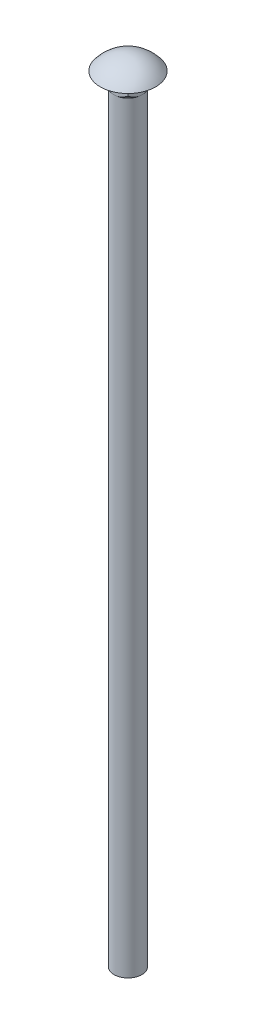
ISO-10303-21;
HEADER;
FILE_DESCRIPTION(('STEP AP214'),'2;1');
FILE_NAME('part.step','',(''),(''),'','','');
FILE_SCHEMA(('AUTOMOTIVE_DESIGN { 1 0 10303 214 1 1 1 1 }'));
ENDSEC;
DATA;
#1=APPLICATION_CONTEXT('core data for automotive mechanical design processes');
#2=APPLICATION_PROTOCOL_DEFINITION('international standard','automotive_design',2000,#1);
#3=PRODUCT_CONTEXT('',#1,'mechanical');
#4=PRODUCT('Part','Part','',(#3));
#5=PRODUCT_RELATED_PRODUCT_CATEGORY('part','',(#4));
#6=PRODUCT_DEFINITION_FORMATION('','',#4);
#7=PRODUCT_DEFINITION_CONTEXT('part definition',#1,'design');
#8=PRODUCT_DEFINITION('design','',#6,#7);
#9=PRODUCT_DEFINITION_SHAPE('','',#8);
#10=(LENGTH_UNIT() NAMED_UNIT(*) SI_UNIT(.MILLI.,.METRE.));
#11=(NAMED_UNIT(*) PLANE_ANGLE_UNIT() SI_UNIT($,.RADIAN.));
#12=(NAMED_UNIT(*) SI_UNIT($,.STERADIAN.) SOLID_ANGLE_UNIT());
#13=UNCERTAINTY_MEASURE_WITH_UNIT(LENGTH_MEASURE(1.E-05),#10,'distance_accuracy_value','');
#14=(GEOMETRIC_REPRESENTATION_CONTEXT(3) GLOBAL_UNCERTAINTY_ASSIGNED_CONTEXT((#13)) GLOBAL_UNIT_ASSIGNED_CONTEXT((#10,
#11,#12)) REPRESENTATION_CONTEXT('',''));
#15=CARTESIAN_POINT('',(0.,0.,0.));
#16=DIRECTION('',(0.,0.,1.));
#17=DIRECTION('',(1.,0.,0.));
#18=AXIS2_PLACEMENT_3D('',#15,#16,#17);
#19=CARTESIAN_POINT('',(-6.35,355.6,-6.35));
#20=DIRECTION('',(1.,0.,0.));
#21=DIRECTION('',(0.,0.,-1.));
#22=AXIS2_PLACEMENT_3D('',#19,#20,#21);
#23=PLANE('',#22);
#24=CARTESIAN_POINT('',(-6.35,364.407985068298,20.5492316571237));
#25=CARTESIAN_POINT('',(-6.35,364.050991119355,20.1755682111338));
#26=CARTESIAN_POINT('',(-6.35,363.694427489481,19.8014926199558));
#27=CARTESIAN_POINT('',(-6.35,362.982345416542,19.0523432680761));
#28=CARTESIAN_POINT('',(-6.35,362.62682698062,18.6772695005867));
#29=CARTESIAN_POINT('',(-6.35,361.916929604104,17.9258543316973));
#30=CARTESIAN_POINT('',(-6.35,361.562550994426,17.5495126175128));
#31=CARTESIAN_POINT('',(-6.35,360.855279749865,16.7954364786473));
#32=CARTESIAN_POINT('',(-6.35,360.502387111519,16.4177020572161));
#33=CARTESIAN_POINT('',(-6.35,359.795978272725,15.6579462645017));
#34=CARTESIAN_POINT('',(-6.35,359.442474542244,15.2759132909628));
#35=CARTESIAN_POINT('',(-6.35,358.737722141089,14.5097734939958));
#36=CARTESIAN_POINT('',(-6.35,358.386473464048,14.1256666764296));
#37=CARTESIAN_POINT('',(-6.35,357.686844487152,13.3549406633708));
#38=CARTESIAN_POINT('',(-6.35,357.338463805638,12.9683218148345));
#39=CARTESIAN_POINT('',(-6.35,356.645311295742,12.1918685454951));
#40=CARTESIAN_POINT('',(-6.35,356.300539426883,11.8020341608478));
#41=CARTESIAN_POINT('',(-6.35,355.56142486667,10.9561945698577));
#42=CARTESIAN_POINT('',(-6.35,355.167880195383,10.4994886062065));
#43=CARTESIAN_POINT('',(-6.35,354.584153440038,9.80876931189498));
#44=CARTESIAN_POINT('',(-6.35,354.390654279711,9.57755914588507));
#45=CARTESIAN_POINT('',(-6.35,354.00633693377,9.11292003207693));
#46=CARTESIAN_POINT('',(-6.35,353.81551873093,8.87949109855043));
#47=CARTESIAN_POINT('',(-6.35,353.437394496755,8.41031763350541));
#48=CARTESIAN_POINT('',(-6.35,353.250084096814,8.17457662886511));
#49=CARTESIAN_POINT('',(-6.35,352.879476012354,7.69996318283963));
#50=CARTESIAN_POINT('',(-6.35,352.696178228094,7.46109081952619));
#51=CARTESIAN_POINT('',(-6.35,352.334656183451,6.97964988721009));
#52=CARTESIAN_POINT('',(-6.35,352.156430261827,6.73708256936971));
#53=CARTESIAN_POINT('',(-6.35,351.806356905895,6.24740192948917));
#54=CARTESIAN_POINT('',(-6.35,351.634508873695,6.00028903683634));
#55=CARTESIAN_POINT('',(-6.35,351.315524773524,5.52507379273032));
#56=CARTESIAN_POINT('',(-6.35,351.16761987235,5.29748989163791));
#57=CARTESIAN_POINT('',(-6.35,350.880350841144,4.83693423201183));
#58=CARTESIAN_POINT('',(-6.35,350.74098764181,4.60396189015308));
#59=CARTESIAN_POINT('',(-6.35,350.47327770716,4.1315733675112));
#60=CARTESIAN_POINT('',(-6.35,350.344935059383,3.8921548387057));
#61=CARTESIAN_POINT('',(-6.35,350.102781839784,3.40617444563433));
#62=CARTESIAN_POINT('',(-6.35,349.988967997608,3.1596142043137));
#63=CARTESIAN_POINT('',(-6.35,349.72332660942,2.52167854120449));
#64=CARTESIAN_POINT('',(-6.35,349.584511136116,2.12450397536433));
#65=CARTESIAN_POINT('',(-6.35,349.425670087264,1.51657178378213));
#66=CARTESIAN_POINT('',(-6.35,349.380983070142,1.31220897893472));
#67=CARTESIAN_POINT('',(-6.35,349.310287699169,0.900224537788461));
#68=CARTESIAN_POINT('',(-6.35,349.284276911088,0.692603329790676));
#69=CARTESIAN_POINT('',(-6.35,349.252424848021,0.273613974452126));
#70=CARTESIAN_POINT('',(-6.35,349.246796781638,0.0622293328966391));
#71=CARTESIAN_POINT('',(-6.35,349.256694413638,-0.360035559707976));
#72=CARTESIAN_POINT('',(-6.35,349.272220251294,-0.570915807427129));
#73=CARTESIAN_POINT('',(-6.35,349.32341890508,-0.990616057163277));
#74=CARTESIAN_POINT('',(-6.35,349.359133497375,-1.19943087063935));
#75=CARTESIAN_POINT('',(-6.35,349.448577899689,-1.61314016288995));
#76=CARTESIAN_POINT('',(-6.35,349.502311980304,-1.81803370014699));
#77=CARTESIAN_POINT('',(-6.35,349.654634979383,-2.32040246048699));
#78=CARTESIAN_POINT('',(-6.35,349.762372568651,-2.61508903697628));
#79=CARTESIAN_POINT('',(-6.35,350.003108275344,-3.19392598496306));
#80=CARTESIAN_POINT('',(-6.35,350.136125160625,-3.47806833968619));
#81=CARTESIAN_POINT('',(-6.35,350.349879722008,-3.89778422017643));
#82=CARTESIAN_POINT('',(-6.35,350.423708511135,-4.03695163213629));
#83=CARTESIAN_POINT('',(-6.35,350.575401867176,-4.31307569079889));
#84=CARTESIAN_POINT('',(-6.35,350.653266478374,-4.45003231322141));
#85=CARTESIAN_POINT('',(-6.35,350.812414232549,-4.72185692181693));
#86=CARTESIAN_POINT('',(-6.35,350.893695880177,-4.85672578699008));
#87=CARTESIAN_POINT('',(-6.35,351.0592334799,-5.124613147354));
#88=CARTESIAN_POINT('',(-6.35,351.143489309054,-5.2576317187138));
#89=CARTESIAN_POINT('',(-6.35,351.43169852583,-5.70303435965351));
#90=CARTESIAN_POINT('',(-6.35,351.641564689349,-6.01159798493695));
#91=CARTESIAN_POINT('',(-6.35,352.071662415089,-6.62144223793977));
#92=CARTESIAN_POINT('',(-6.35,352.291896413995,-6.92272112813805));
#93=CARTESIAN_POINT('',(-6.35,352.740221451194,-7.51972871826681));
#94=CARTESIAN_POINT('',(-6.35,352.968318563863,-7.81545284169642));
#95=CARTESIAN_POINT('',(-6.35,353.430329195087,-8.40226245686343));
#96=CARTESIAN_POINT('',(-6.35,353.664242205843,-8.69334834995883));
#97=CARTESIAN_POINT('',(-6.35,354.137180116613,-9.27252441704587));
#98=CARTESIAN_POINT('',(-6.35,354.376216184142,-9.56060545129358));
#99=CARTESIAN_POINT('',(-6.35,354.857890740808,-10.1337431637271));
#100=CARTESIAN_POINT('',(-6.35,355.100529295724,-10.418799786526));
#101=CARTESIAN_POINT('',(-6.35,355.5885881296,-10.9862969488812));
#102=CARTESIAN_POINT('',(-6.35,355.834007118082,-11.2687385997406));
#103=CARTESIAN_POINT('',(-6.35,356.327205838494,-11.8315546568718));
#104=CARTESIAN_POINT('',(-6.35,356.574985589684,-12.1119290462444));
#105=CARTESIAN_POINT('',(-6.35,357.32156455074,-12.950846989386));
#106=CARTESIAN_POINT('',(-6.35,357.82327188301,-13.506802164091));
#107=CARTESIAN_POINT('',(-6.35,358.832170759314,-14.6138013254313));
#108=CARTESIAN_POINT('',(-6.35,359.339362857287,-15.1648448055578));
#109=CARTESIAN_POINT('',(-6.35,360.357149202763,-16.2625879557062));
#110=CARTESIAN_POINT('',(-6.35,360.867738816152,-16.8092919265057));
#111=CARTESIAN_POINT('',(-6.35,361.891921669361,-17.8998783776843));
#112=CARTESIAN_POINT('',(-6.35,362.405514914795,-18.4437608527862));
#113=CARTESIAN_POINT('',(-6.35,363.044051264105,-19.1170604242459));
#114=CARTESIAN_POINT('',(-6.35,363.167899902421,-19.2475170107212));
#115=CARTESIAN_POINT('',(-6.35,363.415737504732,-19.5083222933041));
#116=CARTESIAN_POINT('',(-6.35,363.539726481798,-19.6386709769942));
#117=CARTESIAN_POINT('',(-6.35,363.787701199087,-19.8991242295469));
#118=CARTESIAN_POINT('',(-6.35,363.911686819756,-20.0292289122538));
#119=CARTESIAN_POINT('',(-6.35,364.159758819817,-20.2893166525354));
#120=CARTESIAN_POINT('',(-6.35,364.283845187546,-20.419299721235));
#121=CARTESIAN_POINT('',(-6.35,364.407985068298,-20.5492316571236));
#122=B_SPLINE_CURVE_WITH_KNOTS('',3,(#24,#25,#26,#27,#28,#29,#30,#31,#32,#33,#34,#35,#36,#37,
#38,#39,#40,#41,#42,#43,#44,#45,#46,#47,#48,#49,#50,#51,#52,#53,#54,#55,#56,#57,#58,#59,#60,#61,
#62,#63,#64,#65,#66,#67,#68,#69,#70,#71,#72,#73,#74,#75,#76,#77,#78,#79,#80,#81,#82,#83,#84,#85,
#86,#87,#88,#89,#90,#91,#92,#93,#94,#95,#96,#97,#98,#99,#100,#101,#102,#103,#104,#105,#106,#107,
#108,#109,#110,#111,#112,#113,#114,#115,#116,#117,#118,#119,#120,#121),.UNSPECIFIED.,.F.,.F.,(4,
2,2,2,2,2,2,2,2,2,2,2,2,2,2,2,2,2,2,2,2,2,2,2,2,2,2,2,2,2,2,2,2,2,2,2,2,2,2,2,2,2,2,2,2,2,2,2,
4),(0.,1.55036247579737,3.10073552091107,4.65152406266354,6.20230898805667,7.76378385213553,
9.32525430490505,10.8865134907791,12.4477551456038,14.2562848915215,15.1607585516256,
16.065226397835,16.9684807714222,17.8717126675394,18.7746452313595,19.6774929353268,
20.4916101962898,21.3058160057924,22.1203225126665,22.9346453540963,24.1920538865342,
24.8189158289117,25.4456960522591,26.0790139262562,26.7123359698995,27.3469733561714,
27.9817612571752,28.9213715874029,29.8616822477871,30.3342437519393,30.806810442519,
31.2791724401169,31.7515149346104,32.8706823104493,33.9901140429873,35.1104308366206,
36.2306501540524,37.3536274217644,38.4766252195413,39.5991215743308,40.7216270950711,
42.9681581170846,45.2149181884492,47.4590694946889,49.7032249966545,50.2428699251448,
50.7825701193184,51.3217332606057,51.8608409944627),.UNSPECIFIED.);
#123=CARTESIAN_POINT('',(-6.35,351.880256121069,6.35000000000008));
#124=VERTEX_POINT('',#123);
#125=CARTESIAN_POINT('',(-6.35,349.25,0.));
#126=VERTEX_POINT('',#125);
#127=EDGE_CURVE('E127',#124,#126,#122,.T.);
#128=ORIENTED_EDGE('',*,*,#127,.F.);
#129=DIRECTION('',(0.,-1.,0.));
#130=VECTOR('',#129,1.);
#131=CARTESIAN_POINT('',(-6.35,355.6,6.35));
#132=LINE('',#131,#130);
#133=CARTESIAN_POINT('',(-6.35,355.6,6.35));
#134=VERTEX_POINT('',#133);
#135=EDGE_CURVE('E132',#134,#124,#132,.T.);
#136=ORIENTED_EDGE('',*,*,#135,.F.);
#137=DIRECTION('',(0.,0.,1.));
#138=VECTOR('',#137,1.);
#139=CARTESIAN_POINT('',(-6.35,355.6,-6.35));
#140=LINE('',#139,#138);
#141=CARTESIAN_POINT('',(-6.35,355.6,-6.35));
#142=VERTEX_POINT('',#141);
#143=EDGE_CURVE('E149',#142,#134,#140,.T.);
#144=ORIENTED_EDGE('',*,*,#143,.F.);
#145=DIRECTION('',(0.,-1.,0.));
#146=VECTOR('',#145,1.);
#147=CARTESIAN_POINT('',(-6.35,355.6,-6.35));
#148=LINE('',#147,#146);
#149=CARTESIAN_POINT('',(-6.35000000000008,351.880256121069,-6.35));
#150=VERTEX_POINT('',#149);
#151=EDGE_CURVE('E138',#142,#150,#148,.T.);
#152=ORIENTED_EDGE('',*,*,#151,.T.);
#153=EDGE_CURVE('E68',#126,#150,#122,.T.);
#154=ORIENTED_EDGE('',*,*,#153,.F.);
#155=EDGE_LOOP('',(#128,#136,#144,#152,#154));
#156=FACE_BOUND('',#155,.T.);
#157=ADVANCED_FACE('F44',(#156),#23,.F.);
#158=CARTESIAN_POINT('',(-6.35,355.6,6.35));
#159=DIRECTION('',(0.,0.,-1.));
#160=DIRECTION('',(-1.,0.,0.));
#161=AXIS2_PLACEMENT_3D('',#158,#159,#160);
#162=PLANE('',#161);
#163=CARTESIAN_POINT('',(20.5492316571237,364.407985068298,6.35));
#164=CARTESIAN_POINT('',(20.1755682111338,364.050991119355,6.35));
#165=CARTESIAN_POINT('',(19.8014926199558,363.694427489481,6.35));
#166=CARTESIAN_POINT('',(19.0523432680761,362.982345416542,6.35));
#167=CARTESIAN_POINT('',(18.6772695005867,362.62682698062,6.35));
#168=CARTESIAN_POINT('',(17.9258543316972,361.916929604104,6.35));
#169=CARTESIAN_POINT('',(17.5495126175127,361.562550994426,6.35));
#170=CARTESIAN_POINT('',(16.7954364786473,360.855279749865,6.35));
#171=CARTESIAN_POINT('',(16.4177020572161,360.502387111519,6.35));
#172=CARTESIAN_POINT('',(15.6579462645017,359.795978272725,6.35));
#173=CARTESIAN_POINT('',(15.2759132909628,359.442474542244,6.35));
#174=CARTESIAN_POINT('',(14.5097734939958,358.737722141089,6.35));
#175=CARTESIAN_POINT('',(14.1256666764296,358.386473464048,6.35));
#176=CARTESIAN_POINT('',(13.3549406633708,357.686844487152,6.35));
#177=CARTESIAN_POINT('',(12.9683218148345,357.338463805638,6.35));
#178=CARTESIAN_POINT('',(12.1918685454951,356.645311295742,6.35));
#179=CARTESIAN_POINT('',(11.8020341608478,356.300539426883,6.35));
#180=CARTESIAN_POINT('',(10.9561945698577,355.56142486667,6.35));
#181=CARTESIAN_POINT('',(10.4994886062065,355.167880195383,6.35));
#182=CARTESIAN_POINT('',(9.80876931189498,354.584153440038,6.35));
#183=CARTESIAN_POINT('',(9.57755914588507,354.390654279711,6.35));
#184=CARTESIAN_POINT('',(9.11292003207693,354.00633693377,6.35));
#185=CARTESIAN_POINT('',(8.87949109855043,353.81551873093,6.35));
#186=CARTESIAN_POINT('',(8.41031763350541,353.437394496755,6.35));
#187=CARTESIAN_POINT('',(8.17457662886511,353.250084096814,6.35));
#188=CARTESIAN_POINT('',(7.69996318283963,352.879476012354,6.35));
#189=CARTESIAN_POINT('',(7.46109081952618,352.696178228094,6.35));
#190=CARTESIAN_POINT('',(6.97964988721008,352.334656183451,6.35));
#191=CARTESIAN_POINT('',(6.7370825693697,352.156430261827,6.35));
#192=CARTESIAN_POINT('',(6.24740192948915,351.806356905895,6.35));
#193=CARTESIAN_POINT('',(6.00028903683633,351.634508873695,6.35));
#194=CARTESIAN_POINT('',(5.52507379273031,351.315524773524,6.35));
#195=CARTESIAN_POINT('',(5.29748989163791,351.16761987235,6.35));
#196=CARTESIAN_POINT('',(4.83693423201184,350.880350841144,6.35));
#197=CARTESIAN_POINT('',(4.60396189015308,350.74098764181,6.35));
#198=CARTESIAN_POINT('',(4.13157336751121,350.47327770716,6.35));
#199=CARTESIAN_POINT('',(3.89215483870572,350.344935059383,6.35));
#200=CARTESIAN_POINT('',(3.40617444563434,350.102781839784,6.35));
#201=CARTESIAN_POINT('',(3.15961420431371,349.988967997608,6.35));
#202=CARTESIAN_POINT('',(2.5216785412045,349.72332660942,6.35));
#203=CARTESIAN_POINT('',(2.12450397536434,349.584511136116,6.35));
#204=CARTESIAN_POINT('',(1.51657178378213,349.425670087264,6.35));
#205=CARTESIAN_POINT('',(1.31220897893472,349.380983070142,6.35));
#206=CARTESIAN_POINT('',(0.900224537788463,349.310287699169,6.35));
#207=CARTESIAN_POINT('',(0.692603329790679,349.284276911088,6.35));
#208=CARTESIAN_POINT('',(0.273613974452125,349.252424848021,6.35));
#209=CARTESIAN_POINT('',(0.0622293328966355,349.246796781638,6.35));
#210=CARTESIAN_POINT('',(-0.360035559707983,349.256694413638,6.35));
#211=CARTESIAN_POINT('',(-0.570915807427137,349.272220251294,6.35));
#212=CARTESIAN_POINT('',(-0.990616057163283,349.32341890508,6.35));
#213=CARTESIAN_POINT('',(-1.19943087063935,349.359133497375,6.35));
#214=CARTESIAN_POINT('',(-1.61314016288995,349.448577899689,6.35));
#215=CARTESIAN_POINT('',(-1.818033700147,349.502311980304,6.35));
#216=CARTESIAN_POINT('',(-2.32040246048701,349.654634979383,6.35));
#217=CARTESIAN_POINT('',(-2.61508903697632,349.762372568651,6.35));
#218=CARTESIAN_POINT('',(-3.1939259849631,350.003108275344,6.35));
#219=CARTESIAN_POINT('',(-3.47806833968621,350.136125160625,6.35));
#220=CARTESIAN_POINT('',(-3.89778422017643,350.349879722008,6.35));
#221=CARTESIAN_POINT('',(-4.0369516321363,350.423708511135,6.35));
#222=CARTESIAN_POINT('',(-4.31307569079888,350.575401867176,6.35));
#223=CARTESIAN_POINT('',(-4.45003231322138,350.653266478374,6.35));
#224=CARTESIAN_POINT('',(-4.72185692181688,350.812414232549,6.35));
#225=CARTESIAN_POINT('',(-4.85672578699002,350.893695880177,6.35));
#226=CARTESIAN_POINT('',(-5.12461314735396,351.0592334799,6.35));
#227=CARTESIAN_POINT('',(-5.25763171871378,351.143489309054,6.35));
#228=CARTESIAN_POINT('',(-5.70303435965349,351.43169852583,6.35));
#229=CARTESIAN_POINT('',(-6.01159798493694,351.641564689349,6.35));
#230=CARTESIAN_POINT('',(-6.62144223793976,352.071662415089,6.35));
#231=CARTESIAN_POINT('',(-6.92272112813805,352.291896413995,6.35));
#232=CARTESIAN_POINT('',(-7.51972871826679,352.740221451194,6.35));
#233=CARTESIAN_POINT('',(-7.81545284169639,352.968318563863,6.35));
#234=CARTESIAN_POINT('',(-8.40226245686341,353.430329195087,6.35));
#235=CARTESIAN_POINT('',(-8.69334834995882,353.664242205843,6.35));
#236=CARTESIAN_POINT('',(-9.27252441704587,354.137180116613,6.35));
#237=CARTESIAN_POINT('',(-9.56060545129358,354.376216184142,6.35));
#238=CARTESIAN_POINT('',(-10.1337431637271,354.857890740808,6.35));
#239=CARTESIAN_POINT('',(-10.418799786526,355.100529295724,6.35));
#240=CARTESIAN_POINT('',(-10.9862969488812,355.5885881296,6.35));
#241=CARTESIAN_POINT('',(-11.2687385997406,355.834007118082,6.35));
#242=CARTESIAN_POINT('',(-11.8315546568718,356.327205838494,6.35));
#243=CARTESIAN_POINT('',(-12.1119290462444,356.574985589684,6.35));
#244=CARTESIAN_POINT('',(-12.950846989386,357.32156455074,6.35));
#245=CARTESIAN_POINT('',(-13.5068021640909,357.82327188301,6.35));
#246=CARTESIAN_POINT('',(-14.6138013254312,358.832170759314,6.35));
#247=CARTESIAN_POINT('',(-15.1648448055578,359.339362857287,6.35));
#248=CARTESIAN_POINT('',(-16.2625879557062,360.357149202763,6.35));
#249=CARTESIAN_POINT('',(-16.8092919265058,360.867738816152,6.35));
#250=CARTESIAN_POINT('',(-17.8998783776843,361.891921669361,6.35));
#251=CARTESIAN_POINT('',(-18.4437608527862,362.405514914795,6.35));
#252=CARTESIAN_POINT('',(-19.1170604242459,363.044051264105,6.35));
#253=CARTESIAN_POINT('',(-19.2475170107212,363.167899902421,6.35));
#254=CARTESIAN_POINT('',(-19.5083222933041,363.415737504732,6.35));
#255=CARTESIAN_POINT('',(-19.6386709769942,363.539726481798,6.35));
#256=CARTESIAN_POINT('',(-19.8991242295469,363.787701199088,6.35));
#257=CARTESIAN_POINT('',(-20.0292289122538,363.911686819756,6.35));
#258=CARTESIAN_POINT('',(-20.2893166525355,364.159758819817,6.35));
#259=CARTESIAN_POINT('',(-20.4192997212351,364.283845187546,6.35));
#260=CARTESIAN_POINT('',(-20.5492316571236,364.407985068298,6.35));
#261=B_SPLINE_CURVE_WITH_KNOTS('',3,(#163,#164,#165,#166,#167,#168,#169,#170,#171,#172,#173,
#174,#175,#176,#177,#178,#179,#180,#181,#182,#183,#184,#185,#186,#187,#188,#189,#190,#191,#192,
#193,#194,#195,#196,#197,#198,#199,#200,#201,#202,#203,#204,#205,#206,#207,#208,#209,#210,#211,
#212,#213,#214,#215,#216,#217,#218,#219,#220,#221,#222,#223,#224,#225,#226,#227,#228,#229,#230,
#231,#232,#233,#234,#235,#236,#237,#238,#239,#240,#241,#242,#243,#244,#245,#246,#247,#248,#249,
#250,#251,#252,#253,#254,#255,#256,#257,#258,#259,#260),.UNSPECIFIED.,.F.,.F.,(4,2,2,2,2,2,2,2,
2,2,2,2,2,2,2,2,2,2,2,2,2,2,2,2,2,2,2,2,2,2,2,2,2,2,2,2,2,2,2,2,2,2,2,2,2,2,2,2,4),(0.,
1.55036247579737,3.10073552091107,4.65152406266362,6.20230898805667,7.76378385213553,
9.32525430490504,10.8865134907791,12.4477551456039,14.2562848915215,15.1607585516256,
16.065226397835,16.9684807714222,17.8717126675394,18.7746452313595,19.6774929353268,
20.4916101962898,21.3058160057924,22.1203225126664,22.9346453540963,24.1920538865342,
24.8189158289117,25.4456960522591,26.0790139262562,26.7123359698995,27.3469733561714,
27.9817612571752,28.921371587403,29.8616822477871,30.3342437519393,30.8068104425189,
31.2791724401168,31.7515149346104,32.8706823104493,33.9901140429873,35.1104308366206,
36.2306501540524,37.3536274217644,38.4766252195413,39.5991215743308,40.7216270950711,
42.9681581170846,45.2149181884492,47.4590694946889,49.7032249966545,50.2428699251448,
50.7825701193185,51.3217332606058,51.8608409944627),.UNSPECIFIED.);
#262=CARTESIAN_POINT('',(6.35,351.880256121069,6.35));
#263=VERTEX_POINT('',#262);
#264=CARTESIAN_POINT('',(0.,349.25,6.35));
#265=VERTEX_POINT('',#264);
#266=EDGE_CURVE('E108',#263,#265,#261,.T.);
#267=ORIENTED_EDGE('',*,*,#266,.F.);
#268=DIRECTION('',(0.,-1.,0.));
#269=VECTOR('',#268,1.);
#270=CARTESIAN_POINT('',(6.35,355.6,6.35));
#271=LINE('',#270,#269);
#272=CARTESIAN_POINT('',(6.35,355.6,6.35));
#273=VERTEX_POINT('',#272);
#274=EDGE_CURVE('E125',#273,#263,#271,.T.);
#275=ORIENTED_EDGE('',*,*,#274,.F.);
#276=DIRECTION('',(1.,0.,0.));
#277=VECTOR('',#276,1.);
#278=CARTESIAN_POINT('',(-6.35,355.6,6.35));
#279=LINE('',#278,#277);
#280=EDGE_CURVE('E146',#134,#273,#279,.T.);
#281=ORIENTED_EDGE('',*,*,#280,.F.);
#282=ORIENTED_EDGE('',*,*,#135,.T.);
#283=EDGE_CURVE('E126',#265,#124,#261,.T.);
#284=ORIENTED_EDGE('',*,*,#283,.F.);
#285=EDGE_LOOP('',(#267,#275,#281,#282,#284));
#286=FACE_BOUND('',#285,.T.);
#287=ADVANCED_FACE('F167',(#286),#162,.F.);
#288=CARTESIAN_POINT('',(6.35,355.6,-6.35));
#289=DIRECTION('',(-1.,0.,0.));
#290=DIRECTION('',(0.,0.,1.));
#291=AXIS2_PLACEMENT_3D('',#288,#289,#290);
#292=PLANE('',#291);
#293=CARTESIAN_POINT('',(6.35,364.407985068298,-20.5492316571237));
#294=CARTESIAN_POINT('',(6.35,364.050991119355,-20.1755682111338));
#295=CARTESIAN_POINT('',(6.35,363.694427489481,-19.8014926199558));
#296=CARTESIAN_POINT('',(6.35,362.982345416542,-19.0523432680761));
#297=CARTESIAN_POINT('',(6.35,362.62682698062,-18.6772695005867));
#298=CARTESIAN_POINT('',(6.35,361.916929604104,-17.9258543316972));
#299=CARTESIAN_POINT('',(6.35,361.562550994426,-17.5495126175127));
#300=CARTESIAN_POINT('',(6.35,360.855279749865,-16.7954364786473));
#301=CARTESIAN_POINT('',(6.35,360.502387111519,-16.4177020572161));
#302=CARTESIAN_POINT('',(6.35,359.795978272725,-15.6579462645017));
#303=CARTESIAN_POINT('',(6.35,359.442474542244,-15.2759132909628));
#304=CARTESIAN_POINT('',(6.35,358.737722141089,-14.5097734939958));
#305=CARTESIAN_POINT('',(6.35,358.386473464048,-14.1256666764296));
#306=CARTESIAN_POINT('',(6.35,357.686844487152,-13.3549406633708));
#307=CARTESIAN_POINT('',(6.35,357.338463805638,-12.9683218148344));
#308=CARTESIAN_POINT('',(6.35,356.645311295742,-12.1918685454951));
#309=CARTESIAN_POINT('',(6.35,356.300539426883,-11.8020341608478));
#310=CARTESIAN_POINT('',(6.35,355.56142486667,-10.9561945698577));
#311=CARTESIAN_POINT('',(6.35,355.167880195383,-10.4994886062065));
#312=CARTESIAN_POINT('',(6.35,354.584153440038,-9.80876931189498));
#313=CARTESIAN_POINT('',(6.35,354.390654279711,-9.57755914588507));
#314=CARTESIAN_POINT('',(6.35,354.00633693377,-9.11292003207693));
#315=CARTESIAN_POINT('',(6.35,353.81551873093,-8.87949109855043));
#316=CARTESIAN_POINT('',(6.35,353.437394496755,-8.41031763350541));
#317=CARTESIAN_POINT('',(6.35,353.250084096814,-8.17457662886511));
#318=CARTESIAN_POINT('',(6.35,352.879476012354,-7.69996318283963));
#319=CARTESIAN_POINT('',(6.35,352.696178228094,-7.46109081952618));
#320=CARTESIAN_POINT('',(6.35,352.334656183451,-6.97964988721008));
#321=CARTESIAN_POINT('',(6.35,352.156430261827,-6.7370825693697));
#322=CARTESIAN_POINT('',(6.35,351.806356905895,-6.24740192948916));
#323=CARTESIAN_POINT('',(6.35,351.634508873695,-6.00028903683633));
#324=CARTESIAN_POINT('',(6.35,351.315524773524,-5.52507379273031));
#325=CARTESIAN_POINT('',(6.35,351.16761987235,-5.29748989163791));
#326=CARTESIAN_POINT('',(6.35,350.880350841144,-4.83693423201184));
#327=CARTESIAN_POINT('',(6.35,350.74098764181,-4.60396189015308));
#328=CARTESIAN_POINT('',(6.35,350.47327770716,-4.13157336751121));
#329=CARTESIAN_POINT('',(6.35,350.344935059383,-3.89215483870572));
#330=CARTESIAN_POINT('',(6.35,350.102781839784,-3.40617444563434));
#331=CARTESIAN_POINT('',(6.35,349.988967997608,-3.15961420431371));
#332=CARTESIAN_POINT('',(6.35,349.72332660942,-2.5216785412045));
#333=CARTESIAN_POINT('',(6.35,349.584511136116,-2.12450397536435));
#334=CARTESIAN_POINT('',(6.35,349.425670087264,-1.51657178378213));
#335=CARTESIAN_POINT('',(6.35,349.380983070142,-1.31220897893472));
#336=CARTESIAN_POINT('',(6.35,349.310287699169,-0.900224537788464));
#337=CARTESIAN_POINT('',(6.35,349.284276911088,-0.692603329790679));
#338=CARTESIAN_POINT('',(6.35,349.252424848021,-0.273613974452127));
#339=CARTESIAN_POINT('',(6.35,349.246796781638,-0.0622293328966371));
#340=CARTESIAN_POINT('',(6.35,349.256694413638,0.360035559707982));
#341=CARTESIAN_POINT('',(6.35,349.272220251294,0.570915807427137));
#342=CARTESIAN_POINT('',(6.35,349.32341890508,0.990616057163281));
#343=CARTESIAN_POINT('',(6.35,349.359133497375,1.19943087063934));
#344=CARTESIAN_POINT('',(6.35,349.448577899689,1.61314016288995));
#345=CARTESIAN_POINT('',(6.35,349.502311980304,1.81803370014699));
#346=CARTESIAN_POINT('',(6.35,349.654634979383,2.32040246048699));
#347=CARTESIAN_POINT('',(6.35,349.762372568651,2.61508903697628));
#348=CARTESIAN_POINT('',(6.35,350.003108275344,3.19392598496306));
#349=CARTESIAN_POINT('',(6.35,350.136125160625,3.47806833968619));
#350=CARTESIAN_POINT('',(6.35,350.349879722008,3.89778422017644));
#351=CARTESIAN_POINT('',(6.35,350.423708511135,4.03695163213631));
#352=CARTESIAN_POINT('',(6.35,350.575401867176,4.31307569079891));
#353=CARTESIAN_POINT('',(6.35,350.653266478374,4.45003231322142));
#354=CARTESIAN_POINT('',(6.35,350.812414232549,4.72185692181693));
#355=CARTESIAN_POINT('',(6.35,350.893695880177,4.85672578699008));
#356=CARTESIAN_POINT('',(6.35,351.0592334799,5.124613147354));
#357=CARTESIAN_POINT('',(6.35,351.143489309054,5.25763171871381));
#358=CARTESIAN_POINT('',(6.35,351.43169852583,5.70303435965351));
#359=CARTESIAN_POINT('',(6.35,351.641564689349,6.01159798493695));
#360=CARTESIAN_POINT('',(6.35,352.071662415089,6.62144223793977));
#361=CARTESIAN_POINT('',(6.35,352.291896413995,6.92272112813805));
#362=CARTESIAN_POINT('',(6.35,352.740221451194,7.51972871826681));
#363=CARTESIAN_POINT('',(6.35,352.968318563863,7.81545284169642));
#364=CARTESIAN_POINT('',(6.35,353.430329195087,8.40226245686343));
#365=CARTESIAN_POINT('',(6.35,353.664242205843,8.69334834995883));
#366=CARTESIAN_POINT('',(6.35,354.137180116613,9.27252441704587));
#367=CARTESIAN_POINT('',(6.35,354.376216184142,9.56060545129358));
#368=CARTESIAN_POINT('',(6.35,354.857890740808,10.1337431637271));
#369=CARTESIAN_POINT('',(6.35,355.100529295724,10.418799786526));
#370=CARTESIAN_POINT('',(6.35,355.5885881296,10.9862969488812));
#371=CARTESIAN_POINT('',(6.35,355.834007118082,11.2687385997406));
#372=CARTESIAN_POINT('',(6.35,356.327205838494,11.8315546568718));
#373=CARTESIAN_POINT('',(6.35,356.574985589684,12.1119290462444));
#374=CARTESIAN_POINT('',(6.35,357.32156455074,12.950846989386));
#375=CARTESIAN_POINT('',(6.35,357.82327188301,13.506802164091));
#376=CARTESIAN_POINT('',(6.35,358.832170759314,14.6138013254313));
#377=CARTESIAN_POINT('',(6.35,359.339362857287,15.1648448055578));
#378=CARTESIAN_POINT('',(6.35,360.357149202763,16.2625879557062));
#379=CARTESIAN_POINT('',(6.35,360.867738816152,16.8092919265057));
#380=CARTESIAN_POINT('',(6.35,361.891921669361,17.8998783776843));
#381=CARTESIAN_POINT('',(6.35,362.405514914795,18.4437608527862));
#382=CARTESIAN_POINT('',(6.35,363.044051264105,19.1170604242459));
#383=CARTESIAN_POINT('',(6.35,363.167899902421,19.2475170107212));
#384=CARTESIAN_POINT('',(6.35,363.415737504732,19.5083222933041));
#385=CARTESIAN_POINT('',(6.35,363.539726481798,19.6386709769942));
#386=CARTESIAN_POINT('',(6.35,363.787701199088,19.8991242295469));
#387=CARTESIAN_POINT('',(6.35,363.911686819756,20.0292289122538));
#388=CARTESIAN_POINT('',(6.35,364.159758819817,20.2893166525355));
#389=CARTESIAN_POINT('',(6.35,364.283845187546,20.4192997212351));
#390=CARTESIAN_POINT('',(6.35,364.407985068298,20.5492316571236));
#391=B_SPLINE_CURVE_WITH_KNOTS('',3,(#293,#294,#295,#296,#297,#298,#299,#300,#301,#302,#303,
#304,#305,#306,#307,#308,#309,#310,#311,#312,#313,#314,#315,#316,#317,#318,#319,#320,#321,#322,
#323,#324,#325,#326,#327,#328,#329,#330,#331,#332,#333,#334,#335,#336,#337,#338,#339,#340,#341,
#342,#343,#344,#345,#346,#347,#348,#349,#350,#351,#352,#353,#354,#355,#356,#357,#358,#359,#360,
#361,#362,#363,#364,#365,#366,#367,#368,#369,#370,#371,#372,#373,#374,#375,#376,#377,#378,#379,
#380,#381,#382,#383,#384,#385,#386,#387,#388,#389,#390),.UNSPECIFIED.,.F.,.F.,(4,2,2,2,2,2,2,2,
2,2,2,2,2,2,2,2,2,2,2,2,2,2,2,2,2,2,2,2,2,2,2,2,2,2,2,2,2,2,2,2,2,2,2,2,2,2,2,2,4),(0.,
1.55036247579737,3.10073552091107,4.65152406266362,6.20230898805667,7.76378385213553,
9.32525430490504,10.8865134907792,12.4477551456038,14.2562848915215,15.1607585516256,
16.065226397835,16.9684807714222,17.8717126675394,18.7746452313595,19.6774929353268,
20.4916101962898,21.3058160057924,22.1203225126664,22.9346453540963,24.1920538865342,
24.8189158289117,25.4456960522591,26.0790139262562,26.7123359698995,27.3469733561714,
27.9817612571752,28.9213715874029,29.8616822477871,30.3342437519393,30.806810442519,
31.2791724401169,31.7515149346104,32.8706823104493,33.9901140429873,35.1104308366206,
36.2306501540524,37.3536274217644,38.4766252195413,39.5991215743308,40.7216270950711,
42.9681581170846,45.2149181884492,47.4590694946889,49.7032249966545,50.2428699251448,
50.7825701193185,51.3217332606058,51.8608409944627),.UNSPECIFIED.);
#392=CARTESIAN_POINT('',(6.35,351.880256121069,-6.35));
#393=VERTEX_POINT('',#392);
#394=CARTESIAN_POINT('',(6.35,349.25,0.));
#395=VERTEX_POINT('',#394);
#396=EDGE_CURVE('E115',#393,#395,#391,.T.);
#397=ORIENTED_EDGE('',*,*,#396,.F.);
#398=DIRECTION('',(0.,-1.,0.));
#399=VECTOR('',#398,1.);
#400=CARTESIAN_POINT('',(6.35,355.6,-6.35));
#401=LINE('',#400,#399);
#402=CARTESIAN_POINT('',(6.35,355.6,-6.35));
#403=VERTEX_POINT('',#402);
#404=EDGE_CURVE('E136',#403,#393,#401,.T.);
#405=ORIENTED_EDGE('',*,*,#404,.F.);
#406=DIRECTION('',(0.,0.,-1.));
#407=VECTOR('',#406,1.);
#408=CARTESIAN_POINT('',(6.35,355.6,-6.35));
#409=LINE('',#408,#407);
#410=EDGE_CURVE('E143',#273,#403,#409,.T.);
#411=ORIENTED_EDGE('',*,*,#410,.F.);
#412=ORIENTED_EDGE('',*,*,#274,.T.);
#413=EDGE_CURVE('E106',#395,#263,#391,.T.);
#414=ORIENTED_EDGE('',*,*,#413,.F.);
#415=EDGE_LOOP('',(#397,#405,#411,#412,#414));
#416=FACE_BOUND('',#415,.T.);
#417=ADVANCED_FACE('F123',(#416),#292,.F.);
#418=CARTESIAN_POINT('',(-6.35,355.6,-6.35));
#419=DIRECTION('',(0.,0.,1.));
#420=DIRECTION('',(1.,0.,0.));
#421=AXIS2_PLACEMENT_3D('',#418,#419,#420);
#422=PLANE('',#421);
#423=CARTESIAN_POINT('',(-20.5492316571237,364.407985068298,-6.35));
#424=CARTESIAN_POINT('',(-20.1755682111338,364.050991119355,-6.35));
#425=CARTESIAN_POINT('',(-19.8014926199558,363.694427489481,-6.35));
#426=CARTESIAN_POINT('',(-19.0523432680761,362.982345416542,-6.35));
#427=CARTESIAN_POINT('',(-18.6772695005867,362.62682698062,-6.35));
#428=CARTESIAN_POINT('',(-17.9258543316972,361.916929604104,-6.35));
#429=CARTESIAN_POINT('',(-17.5495126175127,361.562550994426,-6.35));
#430=CARTESIAN_POINT('',(-16.7954364786473,360.855279749865,-6.35));
#431=CARTESIAN_POINT('',(-16.4177020572161,360.502387111519,-6.35));
#432=CARTESIAN_POINT('',(-15.6579462645017,359.795978272725,-6.35));
#433=CARTESIAN_POINT('',(-15.2759132909628,359.442474542244,-6.35));
#434=CARTESIAN_POINT('',(-14.5097734939958,358.737722141089,-6.35));
#435=CARTESIAN_POINT('',(-14.1256666764296,358.386473464048,-6.35));
#436=CARTESIAN_POINT('',(-13.3549406633708,357.686844487152,-6.35));
#437=CARTESIAN_POINT('',(-12.9683218148345,357.338463805638,-6.35));
#438=CARTESIAN_POINT('',(-12.1918685454951,356.645311295742,-6.35));
#439=CARTESIAN_POINT('',(-11.8020341608478,356.300539426883,-6.35));
#440=CARTESIAN_POINT('',(-10.9561945698577,355.56142486667,-6.35));
#441=CARTESIAN_POINT('',(-10.4994886062065,355.167880195383,-6.35));
#442=CARTESIAN_POINT('',(-9.80876931189498,354.584153440038,-6.35));
#443=CARTESIAN_POINT('',(-9.57755914588507,354.390654279711,-6.35));
#444=CARTESIAN_POINT('',(-9.11292003207693,354.00633693377,-6.35));
#445=CARTESIAN_POINT('',(-8.87949109855043,353.81551873093,-6.35));
#446=CARTESIAN_POINT('',(-8.41031763350541,353.437394496755,-6.35));
#447=CARTESIAN_POINT('',(-8.17457662886511,353.250084096814,-6.35));
#448=CARTESIAN_POINT('',(-7.69996318283963,352.879476012354,-6.35));
#449=CARTESIAN_POINT('',(-7.46109081952618,352.696178228094,-6.35));
#450=CARTESIAN_POINT('',(-6.97964988721008,352.334656183451,-6.35));
#451=CARTESIAN_POINT('',(-6.7370825693697,352.156430261827,-6.35));
#452=CARTESIAN_POINT('',(-6.24740192948915,351.806356905895,-6.35));
#453=CARTESIAN_POINT('',(-6.00028903683633,351.634508873695,-6.35));
#454=CARTESIAN_POINT('',(-5.52507379273031,351.315524773524,-6.35));
#455=CARTESIAN_POINT('',(-5.29748989163791,351.16761987235,-6.35));
#456=CARTESIAN_POINT('',(-4.83693423201184,350.880350841144,-6.35));
#457=CARTESIAN_POINT('',(-4.60396189015308,350.74098764181,-6.35));
#458=CARTESIAN_POINT('',(-4.13157336751121,350.47327770716,-6.35));
#459=CARTESIAN_POINT('',(-3.89215483870572,350.344935059383,-6.35));
#460=CARTESIAN_POINT('',(-3.40617444563434,350.102781839784,-6.35));
#461=CARTESIAN_POINT('',(-3.15961420431371,349.988967997608,-6.35));
#462=CARTESIAN_POINT('',(-2.5216785412045,349.72332660942,-6.35));
#463=CARTESIAN_POINT('',(-2.12450397536434,349.584511136116,-6.35));
#464=CARTESIAN_POINT('',(-1.51657178378213,349.425670087264,-6.35));
#465=CARTESIAN_POINT('',(-1.31220897893472,349.380983070142,-6.35));
#466=CARTESIAN_POINT('',(-0.900224537788463,349.310287699169,-6.35));
#467=CARTESIAN_POINT('',(-0.692603329790679,349.284276911088,-6.35));
#468=CARTESIAN_POINT('',(-0.273613974452125,349.252424848021,-6.35));
#469=CARTESIAN_POINT('',(-0.0622293328966355,349.246796781638,-6.35));
#470=CARTESIAN_POINT('',(0.360035559707983,349.256694413638,-6.35));
#471=CARTESIAN_POINT('',(0.570915807427137,349.272220251294,-6.35));
#472=CARTESIAN_POINT('',(0.990616057163283,349.32341890508,-6.35));
#473=CARTESIAN_POINT('',(1.19943087063935,349.359133497375,-6.35));
#474=CARTESIAN_POINT('',(1.61314016288995,349.448577899689,-6.35));
#475=CARTESIAN_POINT('',(1.818033700147,349.502311980304,-6.35));
#476=CARTESIAN_POINT('',(2.32040246048701,349.654634979383,-6.35));
#477=CARTESIAN_POINT('',(2.61508903697632,349.762372568651,-6.35));
#478=CARTESIAN_POINT('',(3.1939259849631,350.003108275344,-6.35));
#479=CARTESIAN_POINT('',(3.47806833968621,350.136125160625,-6.35));
#480=CARTESIAN_POINT('',(3.89778422017643,350.349879722008,-6.35));
#481=CARTESIAN_POINT('',(4.0369516321363,350.423708511135,-6.35));
#482=CARTESIAN_POINT('',(4.31307569079888,350.575401867176,-6.35));
#483=CARTESIAN_POINT('',(4.45003231322138,350.653266478374,-6.35));
#484=CARTESIAN_POINT('',(4.72185692181688,350.812414232549,-6.35));
#485=CARTESIAN_POINT('',(4.85672578699002,350.893695880177,-6.35));
#486=CARTESIAN_POINT('',(5.12461314735396,351.0592334799,-6.35));
#487=CARTESIAN_POINT('',(5.25763171871378,351.143489309054,-6.35));
#488=CARTESIAN_POINT('',(5.70303435965349,351.43169852583,-6.35));
#489=CARTESIAN_POINT('',(6.01159798493694,351.641564689349,-6.35));
#490=CARTESIAN_POINT('',(6.62144223793976,352.071662415089,-6.35));
#491=CARTESIAN_POINT('',(6.92272112813805,352.291896413995,-6.35));
#492=CARTESIAN_POINT('',(7.51972871826679,352.740221451194,-6.35));
#493=CARTESIAN_POINT('',(7.81545284169639,352.968318563863,-6.35));
#494=CARTESIAN_POINT('',(8.40226245686341,353.430329195087,-6.35));
#495=CARTESIAN_POINT('',(8.69334834995882,353.664242205843,-6.35));
#496=CARTESIAN_POINT('',(9.27252441704587,354.137180116613,-6.35));
#497=CARTESIAN_POINT('',(9.56060545129358,354.376216184142,-6.35));
#498=CARTESIAN_POINT('',(10.1337431637271,354.857890740808,-6.35));
#499=CARTESIAN_POINT('',(10.418799786526,355.100529295724,-6.35));
#500=CARTESIAN_POINT('',(10.9862969488812,355.5885881296,-6.35));
#501=CARTESIAN_POINT('',(11.2687385997406,355.834007118082,-6.35));
#502=CARTESIAN_POINT('',(11.8315546568718,356.327205838494,-6.35));
#503=CARTESIAN_POINT('',(12.1119290462444,356.574985589684,-6.35));
#504=CARTESIAN_POINT('',(12.950846989386,357.32156455074,-6.35));
#505=CARTESIAN_POINT('',(13.5068021640909,357.82327188301,-6.35));
#506=CARTESIAN_POINT('',(14.6138013254312,358.832170759314,-6.35));
#507=CARTESIAN_POINT('',(15.1648448055578,359.339362857287,-6.35));
#508=CARTESIAN_POINT('',(16.2625879557062,360.357149202763,-6.35));
#509=CARTESIAN_POINT('',(16.8092919265058,360.867738816152,-6.35));
#510=CARTESIAN_POINT('',(17.8998783776843,361.891921669361,-6.35));
#511=CARTESIAN_POINT('',(18.4437608527862,362.405514914795,-6.35));
#512=CARTESIAN_POINT('',(19.1170604242459,363.044051264105,-6.35));
#513=CARTESIAN_POINT('',(19.2475170107212,363.167899902421,-6.35));
#514=CARTESIAN_POINT('',(19.5083222933041,363.415737504732,-6.35));
#515=CARTESIAN_POINT('',(19.6386709769942,363.539726481798,-6.35));
#516=CARTESIAN_POINT('',(19.8991242295469,363.787701199088,-6.35));
#517=CARTESIAN_POINT('',(20.0292289122538,363.911686819756,-6.35));
#518=CARTESIAN_POINT('',(20.2893166525355,364.159758819817,-6.35));
#519=CARTESIAN_POINT('',(20.4192997212351,364.283845187546,-6.35));
#520=CARTESIAN_POINT('',(20.5492316571236,364.407985068298,-6.35));
#521=B_SPLINE_CURVE_WITH_KNOTS('',3,(#423,#424,#425,#426,#427,#428,#429,#430,#431,#432,#433,
#434,#435,#436,#437,#438,#439,#440,#441,#442,#443,#444,#445,#446,#447,#448,#449,#450,#451,#452,
#453,#454,#455,#456,#457,#458,#459,#460,#461,#462,#463,#464,#465,#466,#467,#468,#469,#470,#471,
#472,#473,#474,#475,#476,#477,#478,#479,#480,#481,#482,#483,#484,#485,#486,#487,#488,#489,#490,
#491,#492,#493,#494,#495,#496,#497,#498,#499,#500,#501,#502,#503,#504,#505,#506,#507,#508,#509,
#510,#511,#512,#513,#514,#515,#516,#517,#518,#519,#520),.UNSPECIFIED.,.F.,.F.,(4,2,2,2,2,2,2,2,
2,2,2,2,2,2,2,2,2,2,2,2,2,2,2,2,2,2,2,2,2,2,2,2,2,2,2,2,2,2,2,2,2,2,2,2,2,2,2,2,4),(0.,
1.55036247579737,3.10073552091107,4.65152406266362,6.20230898805667,7.76378385213553,
9.32525430490504,10.8865134907791,12.4477551456039,14.2562848915215,15.1607585516256,
16.065226397835,16.9684807714222,17.8717126675394,18.7746452313595,19.6774929353268,
20.4916101962898,21.3058160057924,22.1203225126664,22.9346453540963,24.1920538865342,
24.8189158289117,25.4456960522591,26.0790139262562,26.7123359698995,27.3469733561714,
27.9817612571752,28.921371587403,29.8616822477871,30.3342437519393,30.8068104425189,
31.2791724401168,31.7515149346104,32.8706823104493,33.9901140429873,35.1104308366206,
36.2306501540524,37.3536274217644,38.4766252195413,39.5991215743308,40.7216270950711,
42.9681581170846,45.2149181884492,47.4590694946889,49.7032249966545,50.2428699251448,
50.7825701193185,51.3217332606058,51.8608409944627),.UNSPECIFIED.);
#522=CARTESIAN_POINT('',(0.,349.25,-6.35));
#523=VERTEX_POINT('',#522);
#524=EDGE_CURVE('E61',#150,#523,#521,.T.);
#525=ORIENTED_EDGE('',*,*,#524,.F.);
#526=ORIENTED_EDGE('',*,*,#151,.F.);
#527=DIRECTION('',(-1.,0.,0.));
#528=VECTOR('',#527,1.);
#529=CARTESIAN_POINT('',(-6.35,355.6,-6.35));
#530=LINE('',#529,#528);
#531=EDGE_CURVE('E140',#403,#142,#530,.T.);
#532=ORIENTED_EDGE('',*,*,#531,.F.);
#533=ORIENTED_EDGE('',*,*,#404,.T.);
#534=EDGE_CURVE('E118',#523,#393,#521,.T.);
#535=ORIENTED_EDGE('',*,*,#534,.F.);
#536=EDGE_LOOP('',(#525,#526,#532,#533,#535));
#537=FACE_BOUND('',#536,.T.);
#538=ADVANCED_FACE('F192',(#537),#422,.F.);
#539=CARTESIAN_POINT('',(0.,355.6,0.));
#540=DIRECTION('',(0.,1.,0.));
#541=DIRECTION('',(0.,0.,1.));
#542=AXIS2_PLACEMENT_3D('',#539,#540,#541);
#543=PLANE('',#542);
#544=CARTESIAN_POINT('',(0.,355.6,0.));
#545=DIRECTION('',(0.,1.,0.));
#546=DIRECTION('',(0.,0.,1.));
#547=AXIS2_PLACEMENT_3D('',#544,#545,#546);
#548=CIRCLE('',#547,12.7);
#549=CARTESIAN_POINT('',(0.,355.6,12.7));
#550=VERTEX_POINT('',#549);
#551=EDGE_CURVE('E152',#550,#550,#548,.T.);
#552=ORIENTED_EDGE('',*,*,#551,.F.);
#553=EDGE_LOOP('',(#552));
#554=FACE_BOUND('',#553,.T.);
#555=ORIENTED_EDGE('',*,*,#531,.T.);
#556=ORIENTED_EDGE('',*,*,#143,.T.);
#557=ORIENTED_EDGE('',*,*,#280,.T.);
#558=ORIENTED_EDGE('',*,*,#410,.T.);
#559=EDGE_LOOP('',(#555,#556,#557,#558));
#560=FACE_BOUND('',#559,.T.);
#561=ADVANCED_FACE('F195',(#554,#560),#543,.F.);
#562=CARTESIAN_POINT('',(0.,346.075,0.));
#563=DIRECTION('',(0.,1.,0.));
#564=DIRECTION('',(0.,0.,1.));
#565=AXIS2_PLACEMENT_3D('',#562,#563,#564);
#566=SPHERICAL_SURFACE('',#565,15.875);
#567=CARTESIAN_POINT('',(0.,361.95,0.));
#568=VERTEX_POINT('',#567);
#569=VERTEX_LOOP('',#568);
#570=FACE_BOUND('',#569,.T.);
#571=ORIENTED_EDGE('',*,*,#551,.T.);
#572=EDGE_LOOP('',(#571));
#573=FACE_BOUND('',#572,.T.);
#574=ADVANCED_FACE('F175',(#570,#573),#566,.T.);
#575=CARTESIAN_POINT('',(0.,349.25,0.));
#576=DIRECTION('',(0.,1.,0.));
#577=DIRECTION('',(0.,0.,-1.));
#578=AXIS2_PLACEMENT_3D('',#575,#576,#577);
#579=CONICAL_SURFACE('',#578,6.35,0.78539816339745);
#580=ORIENTED_EDGE('',*,*,#396,.T.);
#581=CARTESIAN_POINT('',(0.,349.25,0.));
#582=DIRECTION('',(0.,1.,0.));
#583=DIRECTION('',(0.,0.,1.));
#584=AXIS2_PLACEMENT_3D('',#581,#582,#583);
#585=CIRCLE('',#584,6.35);
#586=EDGE_CURVE('E53',#395,#523,#585,.T.);
#587=ORIENTED_EDGE('',*,*,#586,.T.);
#588=ORIENTED_EDGE('',*,*,#534,.T.);
#589=EDGE_LOOP('',(#580,#587,#588));
#590=FACE_BOUND('',#589,.T.);
#591=ADVANCED_FACE('F116',(#590),#579,.T.);
#592=ORIENTED_EDGE('',*,*,#153,.T.);
#593=ORIENTED_EDGE('',*,*,#524,.T.);
#594=EDGE_CURVE('E130',#523,#126,#585,.T.);
#595=ORIENTED_EDGE('',*,*,#594,.T.);
#596=EDGE_LOOP('',(#592,#593,#595));
#597=FACE_BOUND('',#596,.T.);
#598=ADVANCED_FACE('F174',(#597),#579,.T.);
#599=ORIENTED_EDGE('',*,*,#266,.T.);
#600=EDGE_CURVE('E12',#265,#395,#585,.T.);
#601=ORIENTED_EDGE('',*,*,#600,.T.);
#602=ORIENTED_EDGE('',*,*,#413,.T.);
#603=EDGE_LOOP('',(#599,#601,#602));
#604=FACE_BOUND('',#603,.T.);
#605=ADVANCED_FACE('F104',(#604),#579,.T.);
#606=ORIENTED_EDGE('',*,*,#283,.T.);
#607=ORIENTED_EDGE('',*,*,#127,.T.);
#608=EDGE_CURVE('E54',#126,#265,#585,.T.);
#609=ORIENTED_EDGE('',*,*,#608,.T.);
#610=EDGE_LOOP('',(#606,#607,#609));
#611=FACE_BOUND('',#610,.T.);
#612=ADVANCED_FACE('F173',(#611),#579,.T.);
#613=CARTESIAN_POINT('',(0.,0.,0.));
#614=DIRECTION('',(0.,1.,0.));
#615=DIRECTION('',(0.,0.,1.));
#616=AXIS2_PLACEMENT_3D('',#613,#614,#615);
#617=PLANE('',#616);
#618=CARTESIAN_POINT('',(0.,0.,0.));
#619=DIRECTION('',(0.,1.,0.));
#620=DIRECTION('',(0.,0.,1.));
#621=AXIS2_PLACEMENT_3D('',#618,#619,#620);
#622=CIRCLE('',#621,6.35);
#623=CARTESIAN_POINT('',(0.,0.,6.35));
#624=VERTEX_POINT('',#623);
#625=EDGE_CURVE('E48',#624,#624,#622,.T.);
#626=ORIENTED_EDGE('',*,*,#625,.F.);
#627=EDGE_LOOP('',(#626));
#628=FACE_BOUND('',#627,.T.);
#629=ADVANCED_FACE('F212',(#628),#617,.F.);
#630=CARTESIAN_POINT('',(0.,349.25,0.));
#631=DIRECTION('',(0.,-1.,0.));
#632=DIRECTION('',(0.,0.,-1.));
#633=AXIS2_PLACEMENT_3D('',#630,#631,#632);
#634=CYLINDRICAL_SURFACE('',#633,6.35);
#635=ORIENTED_EDGE('',*,*,#600,.F.);
#636=ORIENTED_EDGE('',*,*,#608,.F.);
#637=ORIENTED_EDGE('',*,*,#594,.F.);
#638=ORIENTED_EDGE('',*,*,#586,.F.);
#639=EDGE_LOOP('',(#635,#636,#637,#638));
#640=FACE_BOUND('',#639,.T.);
#641=ORIENTED_EDGE('',*,*,#625,.T.);
#642=EDGE_LOOP('',(#641));
#643=FACE_BOUND('',#642,.T.);
#644=ADVANCED_FACE('F46',(#640,#643),#634,.T.);
#645=CLOSED_SHELL('',(#157,#287,#417,#538,#561,#574,#591,#598,#605,#612,#629,#644));
#646=MANIFOLD_SOLID_BREP('B2',#645);
#647=ADVANCED_BREP_SHAPE_REPRESENTATION('',(#18,#646),#14);
#648=SHAPE_DEFINITION_REPRESENTATION(#9,#647);
ENDSEC;
END-ISO-10303-21;
